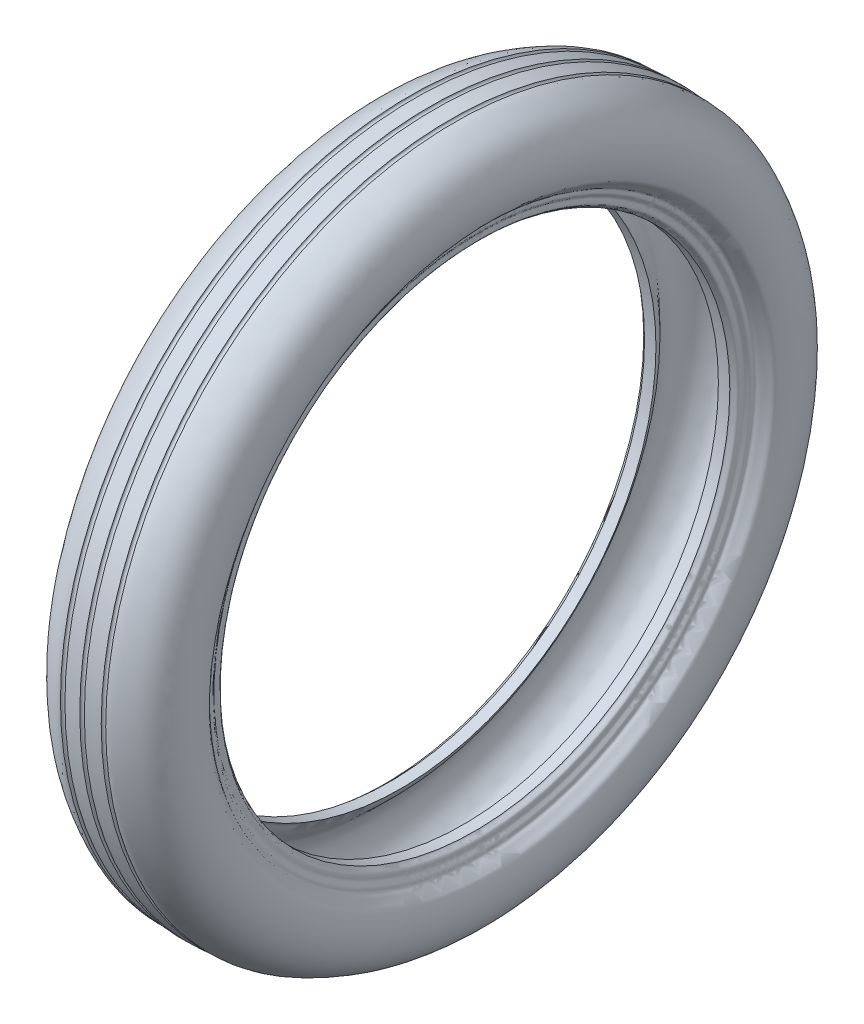
ISO-10303-21;
HEADER;
FILE_DESCRIPTION(('STEP AP214'),'2;1');
FILE_NAME('part.step','',(''),(''),'','','');
FILE_SCHEMA(('AUTOMOTIVE_DESIGN { 1 0 10303 214 1 1 1 1 }'));
ENDSEC;
DATA;
#1=APPLICATION_CONTEXT('core data for automotive mechanical design processes');
#2=APPLICATION_PROTOCOL_DEFINITION('international standard','automotive_design',2000,#1);
#3=PRODUCT_CONTEXT('',#1,'mechanical');
#4=PRODUCT('Part','Part','',(#3));
#5=PRODUCT_RELATED_PRODUCT_CATEGORY('part','',(#4));
#6=PRODUCT_DEFINITION_FORMATION('','',#4);
#7=PRODUCT_DEFINITION_CONTEXT('part definition',#1,'design');
#8=PRODUCT_DEFINITION('design','',#6,#7);
#9=PRODUCT_DEFINITION_SHAPE('','',#8);
#10=(LENGTH_UNIT() NAMED_UNIT(*) SI_UNIT(.MILLI.,.METRE.));
#11=(NAMED_UNIT(*) PLANE_ANGLE_UNIT() SI_UNIT($,.RADIAN.));
#12=(NAMED_UNIT(*) SI_UNIT($,.STERADIAN.) SOLID_ANGLE_UNIT());
#13=UNCERTAINTY_MEASURE_WITH_UNIT(LENGTH_MEASURE(1.E-05),#10,'distance_accuracy_value','');
#14=(GEOMETRIC_REPRESENTATION_CONTEXT(3) GLOBAL_UNCERTAINTY_ASSIGNED_CONTEXT((#13)) GLOBAL_UNIT_ASSIGNED_CONTEXT((#10,
#11,#12)) REPRESENTATION_CONTEXT('',''));
#15=CARTESIAN_POINT('',(0.,0.,0.));
#16=DIRECTION('',(0.,0.,1.));
#17=DIRECTION('',(1.,0.,0.));
#18=AXIS2_PLACEMENT_3D('',#15,#16,#17);
#19=CARTESIAN_POINT('',(-24.8172630139917,203.,0.));
#20=CARTESIAN_POINT('',(-27.2283998288289,205.06391431928,0.));
#21=CARTESIAN_POINT('',(-28.5496427344952,210.327625908058,0.));
#22=CARTESIAN_POINT('',(-33.6712545353592,215.019378984169,0.));
#23=CARTESIAN_POINT('',(-37.7772976660351,219.010363555149,0.));
#24=CARTESIAN_POINT('',(-42.2633577257313,223.062020269606,0.));
#25=CARTESIAN_POINT('',(-45.1671204187017,229.55393791157,0.));
#26=CARTESIAN_POINT('',(-48.0286654197166,236.65779205585,0.));
#27=CARTESIAN_POINT('',(-47.8879674715827,244.882513096217,0.));
#28=CARTESIAN_POINT('',(-46.3948773163548,254.057111445877,0.));
#29=CARTESIAN_POINT('',(-40.3486929351291,261.403587543646,0.));
#30=CARTESIAN_POINT('',(-33.851481321555,268.81086706887,0.));
#31=CARTESIAN_POINT('',(-25.2444175261157,271.404992130535,0.));
#32=CARTESIAN_POINT('',(-16.7423312191855,273.18641912113,0.));
#33=CARTESIAN_POINT('',(-10.1405547550226,273.463220362378,0.));
#34=CARTESIAN_POINT('',(-4.54429512443643,274.014061695448,0.));
#35=CARTESIAN_POINT('',(-1.75340207589833,273.445280920895,0.));
#36=CARTESIAN_POINT('',(0.,273.651830628835,0.));
#37=B_SPLINE_CURVE_WITH_KNOTS('',3,(#19,#20,#21,#22,#23,#24,#25,#26,#27,#28,#29,#30,#31,#32,#33,
#34,#35,#36),.UNSPECIFIED.,.F.,.F.,(4,1,1,1,1,1,1,1,1,1,1,1,1,1,1,4),(0.,0.0822330624444425,
0.137617146698626,0.183009302880853,0.237253629031035,0.297469874379483,0.371716047539101,
0.44060468979368,0.515818013596818,0.616103802574389,0.690267434104086,0.776013817716258,
0.849380324821276,0.924772592656254,0.952990480004338,1.),.UNSPECIFIED.);
#38=CARTESIAN_POINT('',(-102.722911074857,0.,0.));
#39=DIRECTION('',(-1.,0.,0.));
#40=AXIS1_PLACEMENT('',#38,#39);
#41=SURFACE_OF_REVOLUTION('',#37,#40);
#42=CARTESIAN_POINT('',(0.,0.,0.));
#43=DIRECTION('',(1.,0.,0.));
#44=DIRECTION('',(0.,0.,-1.));
#45=AXIS2_PLACEMENT_3D('',#42,#43,#44);
#46=CIRCLE('',#45,273.651830628835);
#47=CARTESIAN_POINT('',(0.,0.,-273.651830628835));
#48=VERTEX_POINT('',#47);
#49=EDGE_CURVE('E10',#48,#48,#46,.T.);
#50=ORIENTED_EDGE('',*,*,#49,.T.);
#51=EDGE_LOOP('',(#50));
#52=FACE_BOUND('',#51,.T.);
#53=CARTESIAN_POINT('',(-24.8172630139917,0.,0.));
#54=DIRECTION('',(1.,0.,0.));
#55=DIRECTION('',(0.,0.,-1.));
#56=AXIS2_PLACEMENT_3D('',#53,#54,#55);
#57=CIRCLE('',#56,203.);
#58=CARTESIAN_POINT('',(-24.8172630139917,0.,-203.));
#59=VERTEX_POINT('',#58);
#60=EDGE_CURVE('E71',#59,#59,#57,.T.);
#61=ORIENTED_EDGE('',*,*,#60,.F.);
#62=EDGE_LOOP('',(#61));
#63=FACE_BOUND('',#62,.T.);
#64=ADVANCED_FACE('F33',(#52,#63),#41,.T.);
#65=CARTESIAN_POINT('',(0.,273.651830628835,0.));
#66=CARTESIAN_POINT('',(1.7534020758983,273.445280920895,0.));
#67=CARTESIAN_POINT('',(4.5442951244364,274.014061695448,0.));
#68=CARTESIAN_POINT('',(10.1405547550225,273.463220362378,0.));
#69=CARTESIAN_POINT('',(16.7423312191854,273.186419121129,0.));
#70=CARTESIAN_POINT('',(25.2444175261157,271.404992130535,0.));
#71=CARTESIAN_POINT('',(33.851481321555,268.81086706887,0.));
#72=CARTESIAN_POINT('',(40.3486929351291,261.403587543646,0.));
#73=CARTESIAN_POINT('',(46.3948773163547,254.057111445877,0.));
#74=CARTESIAN_POINT('',(47.8879674715826,244.882513096217,0.));
#75=CARTESIAN_POINT('',(48.0286654197166,236.65779205585,0.));
#76=CARTESIAN_POINT('',(45.1671204187017,229.55393791157,0.));
#77=CARTESIAN_POINT('',(42.2633577257312,223.062020269606,0.));
#78=CARTESIAN_POINT('',(37.7772976660351,219.010363555149,0.));
#79=CARTESIAN_POINT('',(33.6712545353592,215.019378984169,0.));
#80=CARTESIAN_POINT('',(28.5496427344952,210.327625908058,0.));
#81=CARTESIAN_POINT('',(27.2283998288289,205.06391431928,0.));
#82=CARTESIAN_POINT('',(24.8172630139916,203.,0.));
#83=B_SPLINE_CURVE_WITH_KNOTS('',3,(#65,#66,#67,#68,#69,#70,#71,#72,#73,#74,#75,#76,#77,#78,#79,
#80,#81,#82),.UNSPECIFIED.,.F.,.F.,(4,1,1,1,1,1,1,1,1,1,1,1,1,1,1,4),(0.,0.0470095199956621,
0.0752274073437459,0.150619675178724,0.223986182283742,0.309732565895914,0.383896197425612,
0.484181986403182,0.55939531020632,0.628283952460899,0.702530125620518,0.762746370968965,
0.816990697119147,0.862382853301374,0.917766937555557,1.),.UNSPECIFIED.);
#84=CARTESIAN_POINT('',(-102.722911074857,0.,0.));
#85=DIRECTION('',(-1.,0.,0.));
#86=AXIS1_PLACEMENT('',#84,#85);
#87=SURFACE_OF_REVOLUTION('',#83,#86);
#88=CARTESIAN_POINT('',(24.8172630139917,0.,0.));
#89=DIRECTION('',(1.,0.,0.));
#90=DIRECTION('',(0.,0.,-1.));
#91=AXIS2_PLACEMENT_3D('',#88,#89,#90);
#92=CIRCLE('',#91,203.);
#93=CARTESIAN_POINT('',(24.8172630139917,0.,-203.));
#94=VERTEX_POINT('',#93);
#95=EDGE_CURVE('E40',#94,#94,#92,.T.);
#96=ORIENTED_EDGE('',*,*,#95,.T.);
#97=EDGE_LOOP('',(#96));
#98=FACE_BOUND('',#97,.T.);
#99=ORIENTED_EDGE('',*,*,#49,.F.);
#100=EDGE_LOOP('',(#99));
#101=FACE_BOUND('',#100,.T.);
#102=ADVANCED_FACE('F118',(#98,#101),#87,.T.);
#103=CARTESIAN_POINT('',(-102.722911074857,0.,0.));
#104=DIRECTION('',(-1.,0.,0.));
#105=DIRECTION('',(0.,0.,-1.));
#106=AXIS2_PLACEMENT_3D('',#103,#104,#105);
#107=CYLINDRICAL_SURFACE('',#106,203.);
#108=CARTESIAN_POINT('',(33.9052748219322,0.,0.));
#109=DIRECTION('',(1.,0.,0.));
#110=DIRECTION('',(0.,0.,-1.));
#111=AXIS2_PLACEMENT_3D('',#108,#109,#110);
#112=CIRCLE('',#111,203.);
#113=CARTESIAN_POINT('',(33.9052748219322,0.,-203.));
#114=VERTEX_POINT('',#113);
#115=EDGE_CURVE('E44',#114,#114,#112,.T.);
#116=ORIENTED_EDGE('',*,*,#115,.T.);
#117=EDGE_LOOP('',(#116));
#118=FACE_BOUND('',#117,.T.);
#119=ORIENTED_EDGE('',*,*,#95,.F.);
#120=EDGE_LOOP('',(#119));
#121=FACE_BOUND('',#120,.T.);
#122=ADVANCED_FACE('F115',(#118,#121),#107,.F.);
#123=CARTESIAN_POINT('',(33.9052748219323,203.,0.));
#124=CARTESIAN_POINT('',(34.4514477122976,204.223315441255,0.));
#125=CARTESIAN_POINT('',(38.405176851135,205.210772848352,0.));
#126=CARTESIAN_POINT('',(37.5895196663085,208.702454770499,0.));
#127=CARTESIAN_POINT('',(37.3176730115443,211.637363166268,0.));
#128=CARTESIAN_POINT('',(40.3679293440638,213.465220786409,0.));
#129=CARTESIAN_POINT('',(39.0660676586276,217.086806756293,0.));
#130=CARTESIAN_POINT('',(42.5299588621192,218.987124675277,0.));
#131=CARTESIAN_POINT('',(44.4812031460707,222.024976144124,0.));
#132=CARTESIAN_POINT('',(48.1613248996428,224.664233070907,0.));
#133=CARTESIAN_POINT('',(49.3373100798012,231.297261903147,0.));
#134=CARTESIAN_POINT('',(50.5659703704679,239.217588361253,0.));
#135=CARTESIAN_POINT('',(49.5419089182548,249.309832870114,0.));
#136=CARTESIAN_POINT('',(46.4257794125868,258.785832909676,0.));
#137=CARTESIAN_POINT('',(40.6849116029119,266.454028141102,0.));
#138=CARTESIAN_POINT('',(33.8688282793654,271.544671240841,0.));
#139=CARTESIAN_POINT('',(26.5848661668035,275.239525498986,0.));
#140=CARTESIAN_POINT('',(21.3849500525043,277.770418692312,0.));
#141=CARTESIAN_POINT('',(18.0012541580362,277.496758701426,0.));
#142=B_SPLINE_CURVE_WITH_KNOTS('',3,(#123,#124,#125,#126,#127,#128,#129,#130,#131,#132,#133,
#134,#135,#136,#137,#138,#139,#140,#141),.UNSPECIFIED.,.F.,.F.,(4,1,1,1,1,1,1,1,1,1,1,1,1,1,1,1,
4),(0.,0.0502849018641816,0.0809639249454713,0.0972057606943899,0.139297033110355,
0.164562110942005,0.195188010133947,0.242420179219544,0.280702553209471,0.328072425704126,
0.440671496514186,0.53314982377352,0.638161135079807,0.746440040072595,0.823682365401741,
0.89958494243369,1.),.UNSPECIFIED.);
#143=CARTESIAN_POINT('',(-102.722911074857,0.,0.));
#144=DIRECTION('',(-1.,0.,0.));
#145=AXIS1_PLACEMENT('',#143,#144);
#146=SURFACE_OF_REVOLUTION('',#142,#145);
#147=CARTESIAN_POINT('',(18.0012541580362,0.,0.));
#148=DIRECTION('',(1.,0.,0.));
#149=DIRECTION('',(0.,0.,-1.));
#150=AXIS2_PLACEMENT_3D('',#147,#148,#149);
#151=CIRCLE('',#150,277.496758701426);
#152=CARTESIAN_POINT('',(18.0012541580362,0.,-277.496758701426));
#153=VERTEX_POINT('',#152);
#154=EDGE_CURVE('E48',#153,#153,#151,.T.);
#155=ORIENTED_EDGE('',*,*,#154,.T.);
#156=EDGE_LOOP('',(#155));
#157=FACE_BOUND('',#156,.T.);
#158=ORIENTED_EDGE('',*,*,#115,.F.);
#159=EDGE_LOOP('',(#158));
#160=FACE_BOUND('',#159,.T.);
#161=ADVANCED_FACE('F111',(#157,#160),#146,.T.);
#162=CARTESIAN_POINT('',(16.2157456896604,0.,0.));
#163=DIRECTION('',(-1.,0.,0.));
#164=DIRECTION('',(0.,0.,-1.));
#165=AXIS2_PLACEMENT_3D('',#162,#163,#164);
#166=TOROIDAL_SURFACE('',#165,277.496758701426,1.7855084683758);
#167=CARTESIAN_POINT('',(14.4302372212846,0.,0.));
#168=DIRECTION('',(1.,0.,0.));
#169=DIRECTION('',(0.,0.,-1.));
#170=AXIS2_PLACEMENT_3D('',#167,#168,#169);
#171=CIRCLE('',#170,277.496758701426);
#172=CARTESIAN_POINT('',(14.4302372212846,0.,-277.496758701426));
#173=VERTEX_POINT('',#172);
#174=EDGE_CURVE('E53',#173,#173,#171,.T.);
#175=ORIENTED_EDGE('',*,*,#174,.T.);
#176=EDGE_LOOP('',(#175));
#177=FACE_BOUND('',#176,.T.);
#178=ORIENTED_EDGE('',*,*,#154,.F.);
#179=EDGE_LOOP('',(#178));
#180=FACE_BOUND('',#179,.T.);
#181=ADVANCED_FACE('F107',(#177,#180),#166,.F.);
#182=CARTESIAN_POINT('',(14.4302372212846,0.,0.));
#183=DIRECTION('',(-1.,0.,0.));
#184=DIRECTION('',(0.,0.,-1.));
#185=AXIS2_PLACEMENT_3D('',#182,#183,#184);
#186=CONICAL_SURFACE('',#185,277.496758701426,0.0638636091062138);
#187=CARTESIAN_POINT('',(1.81905865515339,0.,0.));
#188=DIRECTION('',(1.,0.,0.));
#189=DIRECTION('',(0.,0.,-1.));
#190=AXIS2_PLACEMENT_3D('',#187,#188,#189);
#191=CIRCLE('',#190,278.303250820303);
#192=CARTESIAN_POINT('',(1.81905865515339,0.,-278.303250820303));
#193=VERTEX_POINT('',#192);
#194=EDGE_CURVE('E56',#193,#193,#191,.T.);
#195=ORIENTED_EDGE('',*,*,#194,.T.);
#196=EDGE_LOOP('',(#195));
#197=FACE_BOUND('',#196,.T.);
#198=ORIENTED_EDGE('',*,*,#174,.F.);
#199=EDGE_LOOP('',(#198));
#200=FACE_BOUND('',#199,.T.);
#201=ADVANCED_FACE('F103',(#197,#200),#186,.T.);
#202=CARTESIAN_POINT('',(0.,0.,0.));
#203=DIRECTION('',(-1.,0.,0.));
#204=DIRECTION('',(0.,0.,-1.));
#205=AXIS2_PLACEMENT_3D('',#202,#203,#204);
#206=TOROIDAL_SURFACE('',#205,278.303250820303,1.8190586551534);
#207=CARTESIAN_POINT('',(-1.81905865515342,0.,0.));
#208=DIRECTION('',(1.,0.,0.));
#209=DIRECTION('',(0.,0.,-1.));
#210=AXIS2_PLACEMENT_3D('',#207,#208,#209);
#211=CIRCLE('',#210,278.303250820303);
#212=CARTESIAN_POINT('',(-1.81905865515342,0.,-278.303250820303));
#213=VERTEX_POINT('',#212);
#214=EDGE_CURVE('E59',#213,#213,#211,.T.);
#215=ORIENTED_EDGE('',*,*,#214,.T.);
#216=EDGE_LOOP('',(#215));
#217=FACE_BOUND('',#216,.T.);
#218=ORIENTED_EDGE('',*,*,#194,.F.);
#219=EDGE_LOOP('',(#218));
#220=FACE_BOUND('',#219,.T.);
#221=ADVANCED_FACE('F99',(#217,#220),#206,.F.);
#222=CARTESIAN_POINT('',(-1.81905865515342,0.,0.));
#223=DIRECTION('',(1.,0.,0.));
#224=DIRECTION('',(0.,0.,1.));
#225=AXIS2_PLACEMENT_3D('',#222,#223,#224);
#226=CONICAL_SURFACE('',#225,278.303250820303,0.0638636091062136);
#227=CARTESIAN_POINT('',(-14.4302372212846,0.,0.));
#228=DIRECTION('',(1.,0.,0.));
#229=DIRECTION('',(0.,0.,-1.));
#230=AXIS2_PLACEMENT_3D('',#227,#228,#229);
#231=CIRCLE('',#230,277.496758701426);
#232=CARTESIAN_POINT('',(-14.4302372212846,0.,-277.496758701426));
#233=VERTEX_POINT('',#232);
#234=EDGE_CURVE('E62',#233,#233,#231,.T.);
#235=ORIENTED_EDGE('',*,*,#234,.T.);
#236=EDGE_LOOP('',(#235));
#237=FACE_BOUND('',#236,.T.);
#238=ORIENTED_EDGE('',*,*,#214,.F.);
#239=EDGE_LOOP('',(#238));
#240=FACE_BOUND('',#239,.T.);
#241=ADVANCED_FACE('F95',(#237,#240),#226,.T.);
#242=CARTESIAN_POINT('',(-16.2157456896604,0.,0.));
#243=DIRECTION('',(-1.,0.,0.));
#244=DIRECTION('',(0.,0.,-1.));
#245=AXIS2_PLACEMENT_3D('',#242,#243,#244);
#246=TOROIDAL_SURFACE('',#245,277.496758701426,1.78550846837579);
#247=CARTESIAN_POINT('',(-18.0012541580362,0.,0.));
#248=DIRECTION('',(1.,0.,0.));
#249=DIRECTION('',(0.,0.,-1.));
#250=AXIS2_PLACEMENT_3D('',#247,#248,#249);
#251=CIRCLE('',#250,277.496758701426);
#252=CARTESIAN_POINT('',(-18.0012541580362,0.,-277.496758701426));
#253=VERTEX_POINT('',#252);
#254=EDGE_CURVE('E65',#253,#253,#251,.T.);
#255=ORIENTED_EDGE('',*,*,#254,.T.);
#256=EDGE_LOOP('',(#255));
#257=FACE_BOUND('',#256,.T.);
#258=ORIENTED_EDGE('',*,*,#234,.F.);
#259=EDGE_LOOP('',(#258));
#260=FACE_BOUND('',#259,.T.);
#261=ADVANCED_FACE('F91',(#257,#260),#246,.F.);
#262=CARTESIAN_POINT('',(-18.0012541580362,277.496758701426,0.));
#263=CARTESIAN_POINT('',(-21.3849500525043,277.770418692312,0.));
#264=CARTESIAN_POINT('',(-26.5848661668036,275.239525498986,0.));
#265=CARTESIAN_POINT('',(-33.8688282793654,271.544671240841,0.));
#266=CARTESIAN_POINT('',(-40.6849116029119,266.454028141102,0.));
#267=CARTESIAN_POINT('',(-46.4257794125868,258.785832909676,0.));
#268=CARTESIAN_POINT('',(-49.5419089182548,249.309832870114,0.));
#269=CARTESIAN_POINT('',(-50.5659703704679,239.217588361253,0.));
#270=CARTESIAN_POINT('',(-49.3373100798012,231.297261903147,0.));
#271=CARTESIAN_POINT('',(-48.1613248996428,224.664233070907,0.));
#272=CARTESIAN_POINT('',(-44.4812031460707,222.024976144124,0.));
#273=CARTESIAN_POINT('',(-42.5299588621193,218.987124675277,0.));
#274=CARTESIAN_POINT('',(-39.0660676586276,217.086806756293,0.));
#275=CARTESIAN_POINT('',(-40.3679293440638,213.465220786409,0.));
#276=CARTESIAN_POINT('',(-37.3176730115443,211.637363166268,0.));
#277=CARTESIAN_POINT('',(-37.5895196663085,208.702454770499,0.));
#278=CARTESIAN_POINT('',(-38.405176851135,205.210772848352,0.));
#279=CARTESIAN_POINT('',(-34.4514477122976,204.223315441255,0.));
#280=CARTESIAN_POINT('',(-33.9052748219323,203.,0.));
#281=B_SPLINE_CURVE_WITH_KNOTS('',3,(#262,#263,#264,#265,#266,#267,#268,#269,#270,#271,#272,
#273,#274,#275,#276,#277,#278,#279,#280),.UNSPECIFIED.,.F.,.F.,(4,1,1,1,1,1,1,1,1,1,1,1,1,1,1,1,
4),(0.,0.10041505756631,0.176317634598259,0.253559959927405,0.361838864920193,0.46685017622648,
0.559328503485814,0.671927574295874,0.719297446790528,0.757579820780456,0.804811989866053,
0.835437889057995,0.860702966889645,0.90279423930561,0.919036075054529,0.949715098135818,1.),.UNSPECIFIED.);
#282=CARTESIAN_POINT('',(-102.722911074857,0.,0.));
#283=DIRECTION('',(-1.,0.,0.));
#284=AXIS1_PLACEMENT('',#282,#283);
#285=SURFACE_OF_REVOLUTION('',#281,#284);
#286=CARTESIAN_POINT('',(-33.9052748219323,0.,0.));
#287=DIRECTION('',(1.,0.,0.));
#288=DIRECTION('',(0.,0.,-1.));
#289=AXIS2_PLACEMENT_3D('',#286,#287,#288);
#290=CIRCLE('',#289,203.);
#291=CARTESIAN_POINT('',(-33.9052748219323,0.,-203.));
#292=VERTEX_POINT('',#291);
#293=EDGE_CURVE('E68',#292,#292,#290,.T.);
#294=ORIENTED_EDGE('',*,*,#293,.T.);
#295=EDGE_LOOP('',(#294));
#296=FACE_BOUND('',#295,.T.);
#297=ORIENTED_EDGE('',*,*,#254,.F.);
#298=EDGE_LOOP('',(#297));
#299=FACE_BOUND('',#298,.T.);
#300=ADVANCED_FACE('F86',(#296,#299),#285,.T.);
#301=CARTESIAN_POINT('',(-102.722911074857,0.,0.));
#302=DIRECTION('',(-1.,0.,0.));
#303=DIRECTION('',(0.,0.,-1.));
#304=AXIS2_PLACEMENT_3D('',#301,#302,#303);
#305=CYLINDRICAL_SURFACE('',#304,203.);
#306=ORIENTED_EDGE('',*,*,#60,.T.);
#307=EDGE_LOOP('',(#306));
#308=FACE_BOUND('',#307,.T.);
#309=ORIENTED_EDGE('',*,*,#293,.F.);
#310=EDGE_LOOP('',(#309));
#311=FACE_BOUND('',#310,.T.);
#312=ADVANCED_FACE('F90',(#308,#311),#305,.F.);
#313=CLOSED_SHELL('',(#64,#102,#122,#161,#181,#201,#221,#241,#261,#300,#312));
#314=MANIFOLD_SOLID_BREP('B2',#313);
#315=ADVANCED_BREP_SHAPE_REPRESENTATION('',(#18,#314),#14);
#316=SHAPE_DEFINITION_REPRESENTATION(#9,#315);
ENDSEC;
END-ISO-10303-21;
